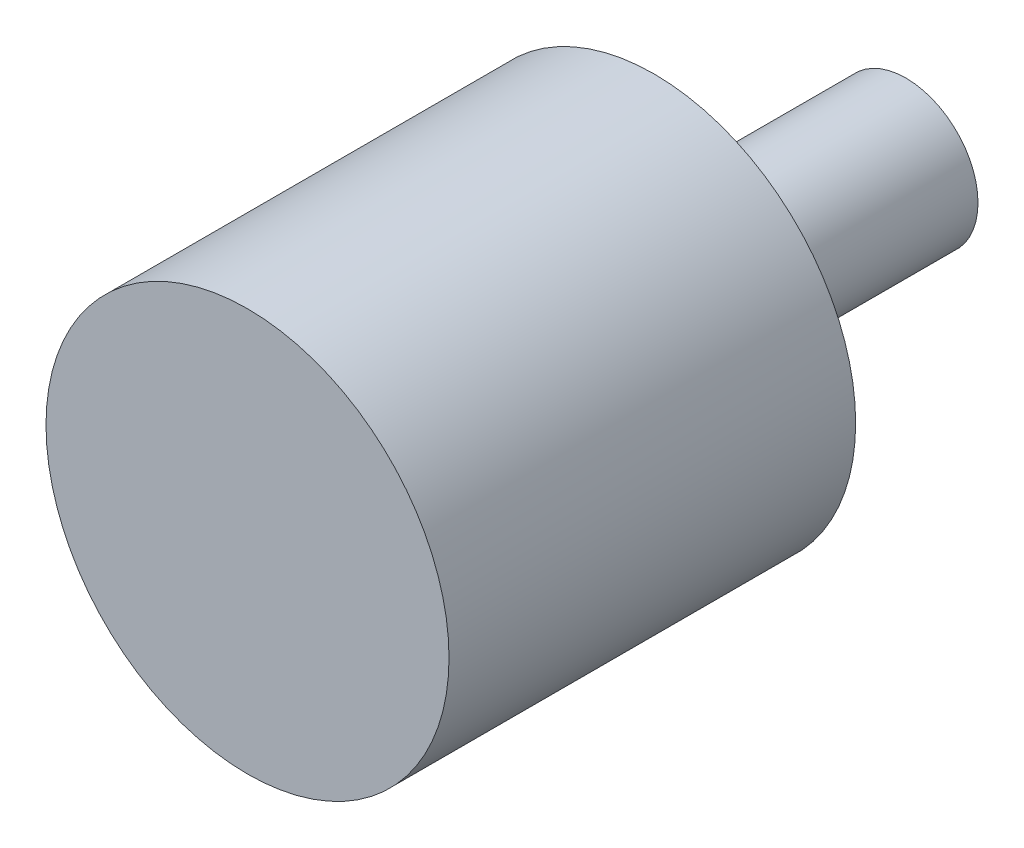
ISO-10303-21;
HEADER;
FILE_DESCRIPTION(('STEP AP214'),'2;1');
FILE_NAME('part.step','',(''),(''),'','','');
FILE_SCHEMA(('AUTOMOTIVE_DESIGN { 1 0 10303 214 1 1 1 1 }'));
ENDSEC;
DATA;
#1=APPLICATION_CONTEXT('core data for automotive mechanical design processes');
#2=APPLICATION_PROTOCOL_DEFINITION('international standard','automotive_design',2000,#1);
#3=PRODUCT_CONTEXT('',#1,'mechanical');
#4=PRODUCT('Part','Part','',(#3));
#5=PRODUCT_RELATED_PRODUCT_CATEGORY('part','',(#4));
#6=PRODUCT_DEFINITION_FORMATION('','',#4);
#7=PRODUCT_DEFINITION_CONTEXT('part definition',#1,'design');
#8=PRODUCT_DEFINITION('design','',#6,#7);
#9=PRODUCT_DEFINITION_SHAPE('','',#8);
#10=(LENGTH_UNIT() NAMED_UNIT(*) SI_UNIT(.MILLI.,.METRE.));
#11=(NAMED_UNIT(*) PLANE_ANGLE_UNIT() SI_UNIT($,.RADIAN.));
#12=(NAMED_UNIT(*) SI_UNIT($,.STERADIAN.) SOLID_ANGLE_UNIT());
#13=UNCERTAINTY_MEASURE_WITH_UNIT(LENGTH_MEASURE(1.E-05),#10,'distance_accuracy_value','');
#14=(GEOMETRIC_REPRESENTATION_CONTEXT(3) GLOBAL_UNCERTAINTY_ASSIGNED_CONTEXT((#13)) GLOBAL_UNIT_ASSIGNED_CONTEXT((#10,
#11,#12)) REPRESENTATION_CONTEXT('',''));
#15=CARTESIAN_POINT('',(0.,0.,0.));
#16=DIRECTION('',(0.,0.,1.));
#17=DIRECTION('',(1.,0.,0.));
#18=AXIS2_PLACEMENT_3D('',#15,#16,#17);
#19=CARTESIAN_POINT('',(0.,0.,0.));
#20=DIRECTION('',(0.,0.,1.));
#21=DIRECTION('',(1.,0.,0.));
#22=AXIS2_PLACEMENT_3D('',#19,#20,#21);
#23=PLANE('',#22);
#24=CARTESIAN_POINT('',(0.,0.,0.));
#25=DIRECTION('',(0.,0.,1.));
#26=DIRECTION('',(1.,0.,0.));
#27=AXIS2_PLACEMENT_3D('',#24,#25,#26);
#28=CIRCLE('',#27,28.);
#29=CARTESIAN_POINT('',(28.,0.,0.));
#30=VERTEX_POINT('',#29);
#31=EDGE_CURVE('E45',#30,#30,#28,.T.);
#32=ORIENTED_EDGE('',*,*,#31,.F.);
#33=EDGE_LOOP('',(#32));
#34=FACE_BOUND('',#33,.T.);
#35=CARTESIAN_POINT('',(0.,0.,0.));
#36=DIRECTION('',(0.,0.,1.));
#37=DIRECTION('',(1.,0.,0.));
#38=AXIS2_PLACEMENT_3D('',#35,#36,#37);
#39=CIRCLE('',#38,26.);
#40=CARTESIAN_POINT('',(26.,0.,0.));
#41=VERTEX_POINT('',#40);
#42=EDGE_CURVE('E49',#41,#41,#39,.T.);
#43=ORIENTED_EDGE('',*,*,#42,.T.);
#44=EDGE_LOOP('',(#43));
#45=FACE_BOUND('',#44,.T.);
#46=ADVANCED_FACE('F38',(#34,#45),#23,.F.);
#47=CARTESIAN_POINT('',(0.,0.,55.));
#48=DIRECTION('',(0.,0.,-1.));
#49=DIRECTION('',(-1.,0.,0.));
#50=AXIS2_PLACEMENT_3D('',#47,#48,#49);
#51=CYLINDRICAL_SURFACE('',#50,28.);
#52=ORIENTED_EDGE('',*,*,#31,.T.);
#53=EDGE_LOOP('',(#52));
#54=FACE_BOUND('',#53,.T.);
#55=CARTESIAN_POINT('',(0.,0.,56.5));
#56=DIRECTION('',(0.,0.,1.));
#57=DIRECTION('',(1.,0.,0.));
#58=AXIS2_PLACEMENT_3D('',#55,#56,#57);
#59=CIRCLE('',#58,28.);
#60=CARTESIAN_POINT('',(28.,0.,56.5));
#61=VERTEX_POINT('',#60);
#62=EDGE_CURVE('E58',#61,#61,#59,.T.);
#63=ORIENTED_EDGE('',*,*,#62,.F.);
#64=EDGE_LOOP('',(#63));
#65=FACE_BOUND('',#64,.T.);
#66=ADVANCED_FACE('F40',(#54,#65),#51,.T.);
#67=CARTESIAN_POINT('',(0.,0.,55.));
#68=DIRECTION('',(0.,0.,-1.));
#69=DIRECTION('',(-1.,0.,0.));
#70=AXIS2_PLACEMENT_3D('',#67,#68,#69);
#71=CYLINDRICAL_SURFACE('',#70,26.);
#72=CARTESIAN_POINT('',(0.,0.,55.));
#73=DIRECTION('',(0.,0.,1.));
#74=DIRECTION('',(1.,0.,0.));
#75=AXIS2_PLACEMENT_3D('',#72,#73,#74);
#76=CIRCLE('',#75,26.);
#77=CARTESIAN_POINT('',(26.,0.,55.));
#78=VERTEX_POINT('',#77);
#79=EDGE_CURVE('E53',#78,#78,#76,.T.);
#80=ORIENTED_EDGE('',*,*,#79,.T.);
#81=EDGE_LOOP('',(#80));
#82=FACE_BOUND('',#81,.T.);
#83=ORIENTED_EDGE('',*,*,#42,.F.);
#84=EDGE_LOOP('',(#83));
#85=FACE_BOUND('',#84,.T.);
#86=ADVANCED_FACE('F84',(#82,#85),#71,.F.);
#87=CARTESIAN_POINT('',(0.,0.,55.));
#88=DIRECTION('',(0.,0.,1.));
#89=DIRECTION('',(1.,0.,0.));
#90=AXIS2_PLACEMENT_3D('',#87,#88,#89);
#91=PLANE('',#90);
#92=CARTESIAN_POINT('',(0.,0.,55.));
#93=DIRECTION('',(0.,0.,1.));
#94=DIRECTION('',(1.,0.,0.));
#95=AXIS2_PLACEMENT_3D('',#92,#93,#94);
#96=CIRCLE('',#95,10.);
#97=CARTESIAN_POINT('',(10.,0.,55.));
#98=VERTEX_POINT('',#97);
#99=EDGE_CURVE('E10',#98,#98,#96,.F.);
#100=ORIENTED_EDGE('',*,*,#99,.F.);
#101=EDGE_LOOP('',(#100));
#102=FACE_BOUND('',#101,.T.);
#103=ORIENTED_EDGE('',*,*,#79,.F.);
#104=EDGE_LOOP('',(#103));
#105=FACE_BOUND('',#104,.T.);
#106=ADVANCED_FACE('F76',(#102,#105),#91,.F.);
#107=CARTESIAN_POINT('',(0.,0.,56.5));
#108=DIRECTION('',(0.,0.,1.));
#109=DIRECTION('',(1.,0.,0.));
#110=AXIS2_PLACEMENT_3D('',#107,#108,#109);
#111=PLANE('',#110);
#112=ORIENTED_EDGE('',*,*,#62,.T.);
#113=EDGE_LOOP('',(#112));
#114=FACE_BOUND('',#113,.T.);
#115=ADVANCED_FACE('F69',(#114),#111,.T.);
#116=CARTESIAN_POINT('',(0.,0.,-35.));
#117=DIRECTION('',(0.,0.,1.));
#118=DIRECTION('',(1.,0.,0.));
#119=AXIS2_PLACEMENT_3D('',#116,#117,#118);
#120=CYLINDRICAL_SURFACE('',#119,10.);
#121=CARTESIAN_POINT('',(0.,0.,-35.));
#122=DIRECTION('',(0.,0.,-1.));
#123=DIRECTION('',(-1.,0.,0.));
#124=AXIS2_PLACEMENT_3D('',#121,#122,#123);
#125=CIRCLE('',#124,10.);
#126=CARTESIAN_POINT('',(-10.,0.,-35.));
#127=VERTEX_POINT('',#126);
#128=EDGE_CURVE('E61',#127,#127,#125,.T.);
#129=ORIENTED_EDGE('',*,*,#128,.F.);
#130=EDGE_LOOP('',(#129));
#131=FACE_BOUND('',#130,.T.);
#132=ORIENTED_EDGE('',*,*,#99,.T.);
#133=EDGE_LOOP('',(#132));
#134=FACE_BOUND('',#133,.T.);
#135=ADVANCED_FACE('F67',(#131,#134),#120,.T.);
#136=CARTESIAN_POINT('',(0.,0.,-35.));
#137=DIRECTION('',(0.,0.,-1.));
#138=DIRECTION('',(-1.,0.,0.));
#139=AXIS2_PLACEMENT_3D('',#136,#137,#138);
#140=PLANE('',#139);
#141=ORIENTED_EDGE('',*,*,#128,.T.);
#142=EDGE_LOOP('',(#141));
#143=FACE_BOUND('',#142,.T.);
#144=ADVANCED_FACE('F65',(#143),#140,.T.);
#145=CLOSED_SHELL('',(#46,#66,#86,#106,#115,#135,#144));
#146=MANIFOLD_SOLID_BREP('B2',#145);
#147=ADVANCED_BREP_SHAPE_REPRESENTATION('',(#18,#146),#14);
#148=SHAPE_DEFINITION_REPRESENTATION(#9,#147);
ENDSEC;
END-ISO-10303-21;
